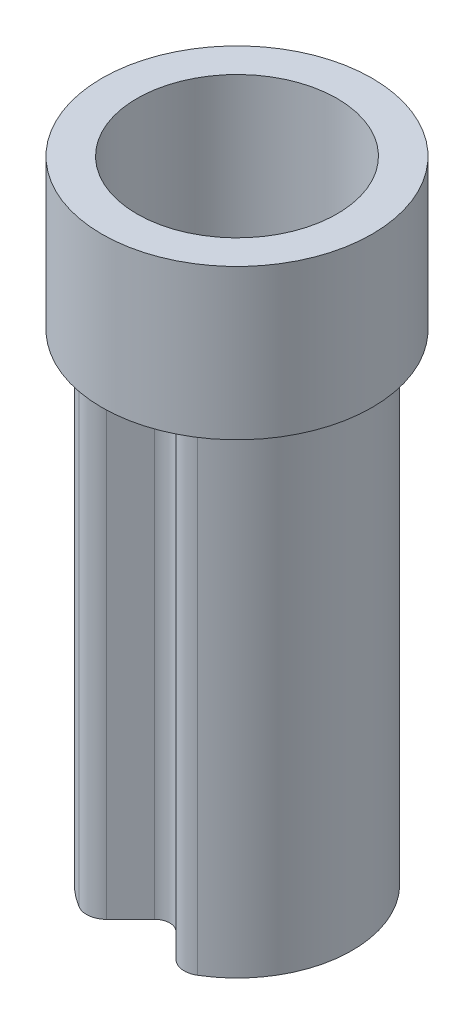
ISO-10303-21;
HEADER;
FILE_DESCRIPTION(('STEP AP214'),'2;1');
FILE_NAME('part.step','',(''),(''),'','','');
FILE_SCHEMA(('AUTOMOTIVE_DESIGN { 1 0 10303 214 1 1 1 1 }'));
ENDSEC;
DATA;
#1=APPLICATION_CONTEXT('core data for automotive mechanical design processes');
#2=APPLICATION_PROTOCOL_DEFINITION('international standard','automotive_design',2000,#1);
#3=PRODUCT_CONTEXT('',#1,'mechanical');
#4=PRODUCT('Part','Part','',(#3));
#5=PRODUCT_RELATED_PRODUCT_CATEGORY('part','',(#4));
#6=PRODUCT_DEFINITION_FORMATION('','',#4);
#7=PRODUCT_DEFINITION_CONTEXT('part definition',#1,'design');
#8=PRODUCT_DEFINITION('design','',#6,#7);
#9=PRODUCT_DEFINITION_SHAPE('','',#8);
#10=(LENGTH_UNIT() NAMED_UNIT(*) SI_UNIT(.MILLI.,.METRE.));
#11=(NAMED_UNIT(*) PLANE_ANGLE_UNIT() SI_UNIT($,.RADIAN.));
#12=(NAMED_UNIT(*) SI_UNIT($,.STERADIAN.) SOLID_ANGLE_UNIT());
#13=UNCERTAINTY_MEASURE_WITH_UNIT(LENGTH_MEASURE(1.E-05),#10,'distance_accuracy_value','');
#14=(GEOMETRIC_REPRESENTATION_CONTEXT(3) GLOBAL_UNCERTAINTY_ASSIGNED_CONTEXT((#13)) GLOBAL_UNIT_ASSIGNED_CONTEXT((#10,
#11,#12)) REPRESENTATION_CONTEXT('',''));
#15=CARTESIAN_POINT('',(0.,0.,0.));
#16=DIRECTION('',(0.,0.,1.));
#17=DIRECTION('',(1.,0.,0.));
#18=AXIS2_PLACEMENT_3D('',#15,#16,#17);
#19=CARTESIAN_POINT('',(0.,4.8,0.822132034355964));
#20=DIRECTION('',(0.,1.,0.));
#21=DIRECTION('',(0.,0.,1.));
#22=AXIS2_PLACEMENT_3D('',#19,#20,#21);
#23=PLANE('',#22);
#24=DIRECTION('',(0.707106781186548,0.,0.707106781186548));
#25=VECTOR('',#24,1.);
#26=CARTESIAN_POINT('',(0.106066017177983,4.8,0.716066017177983));
#27=LINE('',#26,#25);
#28=CARTESIAN_POINT('',(0.106066017177983,4.8,0.716066017177983));
#29=VERTEX_POINT('',#28);
#30=CARTESIAN_POINT('',(0.332945922473057,4.8,0.942945922473057));
#31=VERTEX_POINT('',#30);
#32=EDGE_CURVE('E154',#29,#31,#27,.T.);
#33=ORIENTED_EDGE('',*,*,#32,.T.);
#34=CARTESIAN_POINT('',(0.,4.8,0.));
#35=DIRECTION('',(0.,1.,0.));
#36=DIRECTION('',(0.,0.,1.));
#37=AXIS2_PLACEMENT_3D('',#34,#35,#36);
#38=CIRCLE('',#37,1.);
#39=CARTESIAN_POINT('',(0.513633561053512,4.8,0.858009653185492));
#40=VERTEX_POINT('',#39);
#41=EDGE_CURVE('E137',#31,#40,#38,.T.);
#42=ORIENTED_EDGE('',*,*,#41,.T.);
#43=CARTESIAN_POINT('',(0.487951883000837,4.8,0.815109170526217));
#44=DIRECTION('',(0.,1.,0.));
#45=DIRECTION('',(0.,0.,1.));
#46=AXIS2_PLACEMENT_3D('',#43,#44,#45);
#47=CIRCLE('',#46,0.05);
#48=CARTESIAN_POINT('',(0.452596543941509,4.8,0.850464509585545));
#49=VERTEX_POINT('',#48);
#50=EDGE_CURVE('E194',#40,#49,#47,.F.);
#51=ORIENTED_EDGE('',*,*,#50,.T.);
#52=DIRECTION('',(0.707106781186548,0.,0.707106781186547));
#53=VECTOR('',#52,1.);
#54=CARTESIAN_POINT('',(0.212132034355966,4.8,0.610000000000001));
#55=LINE('',#54,#53);
#56=CARTESIAN_POINT('',(0.212132034355966,4.8,0.610000000000002));
#57=VERTEX_POINT('',#56);
#58=EDGE_CURVE('E227',#57,#49,#55,.T.);
#59=ORIENTED_EDGE('',*,*,#58,.F.);
#60=CARTESIAN_POINT('',(0.,4.8,0.822132034355964));
#61=DIRECTION('',(0.,-1.,0.));
#62=DIRECTION('',(0.,0.,1.));
#63=AXIS2_PLACEMENT_3D('',#60,#61,#62);
#64=CIRCLE('',#63,0.3);
#65=CARTESIAN_POINT('',(-0.212132034355965,4.8,0.610000000000001));
#66=VERTEX_POINT('',#65);
#67=EDGE_CURVE('E223',#66,#57,#64,.T.);
#68=ORIENTED_EDGE('',*,*,#67,.F.);
#69=DIRECTION('',(0.707106781186547,0.,-0.707106781186548));
#70=VECTOR('',#69,1.);
#71=CARTESIAN_POINT('',(-0.479612456619358,4.8,0.877480422263394));
#72=LINE('',#71,#70);
#73=CARTESIAN_POINT('',(-0.452596543941509,4.8,0.850464509585545));
#74=VERTEX_POINT('',#73);
#75=EDGE_CURVE('E221',#74,#66,#72,.T.);
#76=ORIENTED_EDGE('',*,*,#75,.F.);
#77=CARTESIAN_POINT('',(-0.487951883000836,4.8,0.815109170526217));
#78=DIRECTION('',(0.,1.,0.));
#79=DIRECTION('',(0.,0.,1.));
#80=AXIS2_PLACEMENT_3D('',#77,#78,#79);
#81=CIRCLE('',#80,0.05);
#82=CARTESIAN_POINT('',(-0.513633561053512,4.8,0.858009653185492));
#83=VERTEX_POINT('',#82);
#84=EDGE_CURVE('E197',#74,#83,#81,.F.);
#85=ORIENTED_EDGE('',*,*,#84,.T.);
#86=CARTESIAN_POINT('',(-0.332945922473057,4.8,0.942945922473057));
#87=VERTEX_POINT('',#86);
#88=EDGE_CURVE('E12',#83,#87,#38,.T.);
#89=ORIENTED_EDGE('',*,*,#88,.T.);
#90=DIRECTION('',(0.707106781186547,0.,-0.707106781186548));
#91=VECTOR('',#90,1.);
#92=CARTESIAN_POINT('',(-0.448807004477936,4.8,1.05880700447794));
#93=LINE('',#92,#91);
#94=CARTESIAN_POINT('',(-0.106066017177983,4.8,0.716066017177983));
#95=VERTEX_POINT('',#94);
#96=EDGE_CURVE('E164',#87,#95,#93,.T.);
#97=ORIENTED_EDGE('',*,*,#96,.T.);
#98=CARTESIAN_POINT('',(0.,4.8,0.822132034355964));
#99=DIRECTION('',(0.,-1.,0.));
#100=DIRECTION('',(0.,0.,1.));
#101=AXIS2_PLACEMENT_3D('',#98,#99,#100);
#102=CIRCLE('',#101,0.15);
#103=EDGE_CURVE('E159',#95,#29,#102,.T.);
#104=ORIENTED_EDGE('',*,*,#103,.T.);
#105=EDGE_LOOP('',(#33,#42,#51,#59,#68,#76,#85,#89,#97,#104));
#106=FACE_BOUND('',#105,.T.);
#107=ADVANCED_FACE('F36',(#106),#23,.T.);
#108=CARTESIAN_POINT('',(0.,0.,0.822132034355964));
#109=DIRECTION('',(0.,1.,0.));
#110=DIRECTION('',(0.,0.,1.));
#111=AXIS2_PLACEMENT_3D('',#108,#109,#110);
#112=PLANE('',#111);
#113=CARTESIAN_POINT('',(0.,0.,0.));
#114=DIRECTION('',(0.,1.,0.));
#115=DIRECTION('',(0.,0.,1.));
#116=AXIS2_PLACEMENT_3D('',#113,#114,#115);
#117=CIRCLE('',#116,1.15);
#118=CARTESIAN_POINT('',(0.590678595211539,0.,0.986711101163316));
#119=VERTEX_POINT('',#118);
#120=CARTESIAN_POINT('',(-0.590678595211538,0.,0.986711101163316));
#121=VERTEX_POINT('',#120);
#122=EDGE_CURVE('E177',#119,#121,#117,.T.);
#123=ORIENTED_EDGE('',*,*,#122,.F.);
#124=CARTESIAN_POINT('',(0.487951883000836,0.,0.815109170526217));
#125=DIRECTION('',(0.,1.,0.));
#126=DIRECTION('',(0.,0.,1.));
#127=AXIS2_PLACEMENT_3D('',#124,#125,#126);
#128=CIRCLE('',#127,0.2);
#129=CARTESIAN_POINT('',(0.346530526763527,0.,0.956530526763527));
#130=VERTEX_POINT('',#129);
#131=EDGE_CURVE('E61',#119,#130,#128,.F.);
#132=ORIENTED_EDGE('',*,*,#131,.T.);
#133=DIRECTION('',(0.707106781186548,0.,0.707106781186548));
#134=VECTOR('',#133,1.);
#135=CARTESIAN_POINT('',(0.106066017177983,0.,0.716066017177983));
#136=LINE('',#135,#134);
#137=CARTESIAN_POINT('',(0.106066017177983,0.,0.716066017177983));
#138=VERTEX_POINT('',#137);
#139=EDGE_CURVE('E174',#138,#130,#136,.T.);
#140=ORIENTED_EDGE('',*,*,#139,.F.);
#141=CARTESIAN_POINT('',(0.,0.,0.822132034355964));
#142=DIRECTION('',(0.,-1.,0.));
#143=DIRECTION('',(0.,0.,1.));
#144=AXIS2_PLACEMENT_3D('',#141,#142,#143);
#145=CIRCLE('',#144,0.15);
#146=CARTESIAN_POINT('',(-0.106066017177983,0.,0.716066017177983));
#147=VERTEX_POINT('',#146);
#148=EDGE_CURVE('E171',#147,#138,#145,.T.);
#149=ORIENTED_EDGE('',*,*,#148,.F.);
#150=DIRECTION('',(0.707106781186547,0.,-0.707106781186548));
#151=VECTOR('',#150,1.);
#152=CARTESIAN_POINT('',(-0.448807004477936,0.,1.05880700447794));
#153=LINE('',#152,#151);
#154=CARTESIAN_POINT('',(-0.346530526763527,0.,0.956530526763527));
#155=VERTEX_POINT('',#154);
#156=EDGE_CURVE('E180',#155,#147,#153,.T.);
#157=ORIENTED_EDGE('',*,*,#156,.F.);
#158=CARTESIAN_POINT('',(-0.487951883000836,0.,0.815109170526218));
#159=DIRECTION('',(0.,1.,0.));
#160=DIRECTION('',(0.,0.,1.));
#161=AXIS2_PLACEMENT_3D('',#158,#159,#160);
#162=CIRCLE('',#161,0.2);
#163=EDGE_CURVE('E204',#155,#121,#162,.F.);
#164=ORIENTED_EDGE('',*,*,#163,.T.);
#165=EDGE_LOOP('',(#123,#132,#140,#149,#157,#164));
#166=FACE_BOUND('',#165,.T.);
#167=DIRECTION('',(0.707106781186548,0.,0.707106781186547));
#168=VECTOR('',#167,1.);
#169=CARTESIAN_POINT('',(0.212132034355966,0.,0.610000000000001));
#170=LINE('',#169,#168);
#171=CARTESIAN_POINT('',(0.212132034355966,0.,0.610000000000002));
#172=VERTEX_POINT('',#171);
#173=CARTESIAN_POINT('',(0.452596543941509,0.,0.850464509585545));
#174=VERTEX_POINT('',#173);
#175=EDGE_CURVE('E224',#172,#174,#170,.T.);
#176=ORIENTED_EDGE('',*,*,#175,.T.);
#177=CARTESIAN_POINT('',(0.487951883000837,0.,0.815109170526217));
#178=DIRECTION('',(0.,1.,0.));
#179=DIRECTION('',(0.,0.,1.));
#180=AXIS2_PLACEMENT_3D('',#177,#178,#179);
#181=CIRCLE('',#180,0.05);
#182=CARTESIAN_POINT('',(0.513633561053512,0.,0.858009653185492));
#183=VERTEX_POINT('',#182);
#184=EDGE_CURVE('E192',#174,#183,#181,.T.);
#185=ORIENTED_EDGE('',*,*,#184,.T.);
#186=CARTESIAN_POINT('',(0.,0.,0.));
#187=DIRECTION('',(0.,1.,0.));
#188=DIRECTION('',(0.,0.,1.));
#189=AXIS2_PLACEMENT_3D('',#186,#187,#188);
#190=CIRCLE('',#189,1.);
#191=CARTESIAN_POINT('',(-0.513633561053512,0.,0.858009653185492));
#192=VERTEX_POINT('',#191);
#193=EDGE_CURVE('E231',#183,#192,#190,.T.);
#194=ORIENTED_EDGE('',*,*,#193,.T.);
#195=CARTESIAN_POINT('',(-0.487951883000836,0.,0.815109170526217));
#196=DIRECTION('',(0.,1.,0.));
#197=DIRECTION('',(0.,0.,1.));
#198=AXIS2_PLACEMENT_3D('',#195,#196,#197);
#199=CIRCLE('',#198,0.05);
#200=CARTESIAN_POINT('',(-0.452596543941509,0.,0.850464509585545));
#201=VERTEX_POINT('',#200);
#202=EDGE_CURVE('E195',#192,#201,#199,.T.);
#203=ORIENTED_EDGE('',*,*,#202,.T.);
#204=DIRECTION('',(0.707106781186547,0.,-0.707106781186548));
#205=VECTOR('',#204,1.);
#206=CARTESIAN_POINT('',(-0.479612456619358,0.,0.877480422263394));
#207=LINE('',#206,#205);
#208=CARTESIAN_POINT('',(-0.212132034355965,0.,0.610000000000001));
#209=VERTEX_POINT('',#208);
#210=EDGE_CURVE('E234',#201,#209,#207,.T.);
#211=ORIENTED_EDGE('',*,*,#210,.T.);
#212=CARTESIAN_POINT('',(0.,0.,0.822132034355964));
#213=DIRECTION('',(0.,-1.,0.));
#214=DIRECTION('',(0.,0.,1.));
#215=AXIS2_PLACEMENT_3D('',#212,#213,#214);
#216=CIRCLE('',#215,0.3);
#217=EDGE_CURVE('E237',#209,#172,#216,.T.);
#218=ORIENTED_EDGE('',*,*,#217,.T.);
#219=EDGE_LOOP('',(#176,#185,#194,#203,#211,#218));
#220=FACE_BOUND('',#219,.T.);
#221=ADVANCED_FACE('F255',(#166,#220),#112,.F.);
#222=CARTESIAN_POINT('',(0.,4.8,0.822132034355964));
#223=DIRECTION('',(0.,-1.,0.));
#224=DIRECTION('',(0.,0.,-1.));
#225=AXIS2_PLACEMENT_3D('',#222,#223,#224);
#226=CYLINDRICAL_SURFACE('',#225,0.15);
#227=ORIENTED_EDGE('',*,*,#148,.T.);
#228=DIRECTION('',(0.,-1.,0.));
#229=VECTOR('',#228,1.);
#230=CARTESIAN_POINT('',(0.106066017177983,4.8,0.716066017177983));
#231=LINE('',#230,#229);
#232=EDGE_CURVE('E184',#29,#138,#231,.T.);
#233=ORIENTED_EDGE('',*,*,#232,.F.);
#234=ORIENTED_EDGE('',*,*,#103,.F.);
#235=DIRECTION('',(0.,-1.,0.));
#236=VECTOR('',#235,1.);
#237=CARTESIAN_POINT('',(-0.106066017177983,4.8,0.716066017177983));
#238=LINE('',#237,#236);
#239=EDGE_CURVE('E170',#95,#147,#238,.T.);
#240=ORIENTED_EDGE('',*,*,#239,.T.);
#241=EDGE_LOOP('',(#227,#233,#234,#240));
#242=FACE_BOUND('',#241,.T.);
#243=ADVANCED_FACE('F291',(#242),#226,.F.);
#244=CARTESIAN_POINT('',(0.106066017177983,4.8,0.716066017177983));
#245=DIRECTION('',(0.707106781186548,0.,-0.707106781186547));
#246=DIRECTION('',(-0.707106781186547,0.,-0.707106781186548));
#247=AXIS2_PLACEMENT_3D('',#244,#245,#246);
#248=PLANE('',#247);
#249=ORIENTED_EDGE('',*,*,#139,.T.);
#250=DIRECTION('',(0.,-1.,0.));
#251=VECTOR('',#250,1.);
#252=CARTESIAN_POINT('',(0.346530526763527,4.8,0.956530526763527));
#253=LINE('',#252,#251);
#254=CARTESIAN_POINT('',(0.346530526763527,4.8,0.956530526763527));
#255=VERTEX_POINT('',#254);
#256=EDGE_CURVE('E157',#130,#255,#253,.F.);
#257=ORIENTED_EDGE('',*,*,#256,.T.);
#258=EDGE_CURVE('E133',#31,#255,#27,.T.);
#259=ORIENTED_EDGE('',*,*,#258,.F.);
#260=ORIENTED_EDGE('',*,*,#32,.F.);
#261=ORIENTED_EDGE('',*,*,#232,.T.);
#262=EDGE_LOOP('',(#249,#257,#259,#260,#261));
#263=FACE_BOUND('',#262,.T.);
#264=ADVANCED_FACE('F152',(#263),#248,.F.);
#265=CARTESIAN_POINT('',(0.,4.8,0.));
#266=DIRECTION('',(0.,-1.,0.));
#267=DIRECTION('',(0.,0.,-1.));
#268=AXIS2_PLACEMENT_3D('',#265,#266,#267);
#269=CYLINDRICAL_SURFACE('',#268,1.15);
#270=CARTESIAN_POINT('',(0.,4.8,0.));
#271=DIRECTION('',(0.,1.,0.));
#272=DIRECTION('',(0.,0.,1.));
#273=AXIS2_PLACEMENT_3D('',#270,#271,#272);
#274=CIRCLE('',#273,1.15);
#275=CARTESIAN_POINT('',(0.590678595211539,4.8,0.986711101163316));
#276=VERTEX_POINT('',#275);
#277=CARTESIAN_POINT('',(-0.590678595211538,4.8,0.986711101163316));
#278=VERTEX_POINT('',#277);
#279=EDGE_CURVE('E163',#276,#278,#274,.T.);
#280=ORIENTED_EDGE('',*,*,#279,.F.);
#281=DIRECTION('',(0.,-1.,0.));
#282=VECTOR('',#281,1.);
#283=CARTESIAN_POINT('',(0.590678595211539,4.8,0.986711101163316));
#284=LINE('',#283,#282);
#285=EDGE_CURVE('E201',#276,#119,#284,.T.);
#286=ORIENTED_EDGE('',*,*,#285,.T.);
#287=ORIENTED_EDGE('',*,*,#122,.T.);
#288=DIRECTION('',(0.,-1.,0.));
#289=VECTOR('',#288,1.);
#290=CARTESIAN_POINT('',(-0.590678595211539,4.8,0.986711101163316));
#291=LINE('',#290,#289);
#292=EDGE_CURVE('E198',#121,#278,#291,.F.);
#293=ORIENTED_EDGE('',*,*,#292,.T.);
#294=EDGE_LOOP('',(#280,#286,#287,#293));
#295=FACE_BOUND('',#294,.T.);
#296=ADVANCED_FACE('F299',(#295),#269,.T.);
#297=CARTESIAN_POINT('',(-0.448807004477936,4.8,1.05880700447794));
#298=DIRECTION('',(-0.707106781186548,0.,-0.707106781186547));
#299=DIRECTION('',(-0.707106781186547,0.,0.707106781186548));
#300=AXIS2_PLACEMENT_3D('',#297,#298,#299);
#301=PLANE('',#300);
#302=CARTESIAN_POINT('',(-0.346530526763527,4.8,0.956530526763527));
#303=VERTEX_POINT('',#302);
#304=EDGE_CURVE('E136',#303,#87,#93,.T.);
#305=ORIENTED_EDGE('',*,*,#304,.F.);
#306=DIRECTION('',(0.,-1.,0.));
#307=VECTOR('',#306,1.);
#308=CARTESIAN_POINT('',(-0.346530526763527,4.8,0.956530526763527));
#309=LINE('',#308,#307);
#310=EDGE_CURVE('E45',#303,#155,#309,.T.);
#311=ORIENTED_EDGE('',*,*,#310,.T.);
#312=ORIENTED_EDGE('',*,*,#156,.T.);
#313=ORIENTED_EDGE('',*,*,#239,.F.);
#314=ORIENTED_EDGE('',*,*,#96,.F.);
#315=EDGE_LOOP('',(#305,#311,#312,#313,#314));
#316=FACE_BOUND('',#315,.T.);
#317=ADVANCED_FACE('F296',(#316),#301,.F.);
#318=CARTESIAN_POINT('',(0.,4.8,0.));
#319=DIRECTION('',(0.,-1.,0.));
#320=DIRECTION('',(0.,0.,-1.));
#321=AXIS2_PLACEMENT_3D('',#318,#319,#320);
#322=CYLINDRICAL_SURFACE('',#321,1.);
#323=ORIENTED_EDGE('',*,*,#193,.F.);
#324=DIRECTION('',(0.,-1.,0.));
#325=VECTOR('',#324,1.);
#326=CARTESIAN_POINT('',(0.513633561053512,4.8,0.858009653185492));
#327=LINE('',#326,#325);
#328=EDGE_CURVE('E145',#183,#40,#327,.F.);
#329=ORIENTED_EDGE('',*,*,#328,.T.);
#330=ORIENTED_EDGE('',*,*,#41,.F.);
#331=EDGE_CURVE('E53',#87,#31,#38,.T.);
#332=ORIENTED_EDGE('',*,*,#331,.F.);
#333=ORIENTED_EDGE('',*,*,#88,.F.);
#334=DIRECTION('',(0.,-1.,0.));
#335=VECTOR('',#334,1.);
#336=CARTESIAN_POINT('',(-0.513633561053512,4.8,0.858009653185492));
#337=LINE('',#336,#335);
#338=EDGE_CURVE('E189',#83,#192,#337,.T.);
#339=ORIENTED_EDGE('',*,*,#338,.T.);
#340=EDGE_LOOP('',(#323,#329,#330,#332,#333,#339));
#341=FACE_BOUND('',#340,.T.);
#342=CARTESIAN_POINT('',(0.,6.3,0.));
#343=DIRECTION('',(0.,1.,0.));
#344=DIRECTION('',(0.,0.,1.));
#345=AXIS2_PLACEMENT_3D('',#342,#343,#344);
#346=CIRCLE('',#345,1.);
#347=CARTESIAN_POINT('',(0.,6.3,1.));
#348=VERTEX_POINT('',#347);
#349=EDGE_CURVE('E138',#348,#348,#346,.T.);
#350=ORIENTED_EDGE('',*,*,#349,.T.);
#351=EDGE_LOOP('',(#350));
#352=FACE_BOUND('',#351,.T.);
#353=ADVANCED_FACE('F142',(#341,#352),#322,.F.);
#354=CARTESIAN_POINT('',(-0.479612456619358,4.8,0.877480422263394));
#355=DIRECTION('',(-0.707106781186548,0.,-0.707106781186547));
#356=DIRECTION('',(-0.707106781186547,0.,0.707106781186548));
#357=AXIS2_PLACEMENT_3D('',#354,#355,#356);
#358=PLANE('',#357);
#359=ORIENTED_EDGE('',*,*,#210,.F.);
#360=DIRECTION('',(0.,1.,0.));
#361=VECTOR('',#360,1.);
#362=CARTESIAN_POINT('',(-0.452596543941509,4.8,0.850464509585545));
#363=LINE('',#362,#361);
#364=EDGE_CURVE('E190',#201,#74,#363,.T.);
#365=ORIENTED_EDGE('',*,*,#364,.T.);
#366=ORIENTED_EDGE('',*,*,#75,.T.);
#367=DIRECTION('',(0.,-1.,0.));
#368=VECTOR('',#367,1.);
#369=CARTESIAN_POINT('',(-0.212132034355965,4.8,0.610000000000001));
#370=LINE('',#369,#368);
#371=EDGE_CURVE('E175',#66,#209,#370,.T.);
#372=ORIENTED_EDGE('',*,*,#371,.T.);
#373=EDGE_LOOP('',(#359,#365,#366,#372));
#374=FACE_BOUND('',#373,.T.);
#375=ADVANCED_FACE('F247',(#374),#358,.T.);
#376=CARTESIAN_POINT('',(0.,4.8,0.822132034355964));
#377=DIRECTION('',(0.,-1.,0.));
#378=DIRECTION('',(0.,0.,-1.));
#379=AXIS2_PLACEMENT_3D('',#376,#377,#378);
#380=CYLINDRICAL_SURFACE('',#379,0.3);
#381=ORIENTED_EDGE('',*,*,#217,.F.);
#382=ORIENTED_EDGE('',*,*,#371,.F.);
#383=ORIENTED_EDGE('',*,*,#67,.T.);
#384=DIRECTION('',(0.,-1.,0.));
#385=VECTOR('',#384,1.);
#386=CARTESIAN_POINT('',(0.212132034355966,4.8,0.610000000000002));
#387=LINE('',#386,#385);
#388=EDGE_CURVE('E230',#57,#172,#387,.T.);
#389=ORIENTED_EDGE('',*,*,#388,.T.);
#390=EDGE_LOOP('',(#381,#382,#383,#389));
#391=FACE_BOUND('',#390,.T.);
#392=ADVANCED_FACE('F252',(#391),#380,.T.);
#393=CARTESIAN_POINT('',(0.212132034355966,4.8,0.610000000000001));
#394=DIRECTION('',(0.707106781186547,0.,-0.707106781186548));
#395=DIRECTION('',(-0.707106781186548,0.,-0.707106781186547));
#396=AXIS2_PLACEMENT_3D('',#393,#394,#395);
#397=PLANE('',#396);
#398=ORIENTED_EDGE('',*,*,#58,.T.);
#399=DIRECTION('',(0.,1.,0.));
#400=VECTOR('',#399,1.);
#401=CARTESIAN_POINT('',(0.452596543941509,0.,0.850464509585545));
#402=LINE('',#401,#400);
#403=EDGE_CURVE('E186',#49,#174,#402,.F.);
#404=ORIENTED_EDGE('',*,*,#403,.T.);
#405=ORIENTED_EDGE('',*,*,#175,.F.);
#406=ORIENTED_EDGE('',*,*,#388,.F.);
#407=EDGE_LOOP('',(#398,#404,#405,#406));
#408=FACE_BOUND('',#407,.T.);
#409=ADVANCED_FACE('F274',(#408),#397,.T.);
#410=CARTESIAN_POINT('',(0.487951883000837,4.8,0.815109170526217));
#411=DIRECTION('',(0.,-1.,0.));
#412=DIRECTION('',(0.,0.,-1.));
#413=AXIS2_PLACEMENT_3D('',#410,#411,#412);
#414=CYLINDRICAL_SURFACE('',#413,0.05);
#415=ORIENTED_EDGE('',*,*,#50,.F.);
#416=ORIENTED_EDGE('',*,*,#328,.F.);
#417=ORIENTED_EDGE('',*,*,#184,.F.);
#418=ORIENTED_EDGE('',*,*,#403,.F.);
#419=EDGE_LOOP('',(#415,#416,#417,#418));
#420=FACE_BOUND('',#419,.T.);
#421=ADVANCED_FACE('F275',(#420),#414,.F.);
#422=CARTESIAN_POINT('',(-0.487951883000836,4.8,0.815109170526217));
#423=DIRECTION('',(0.,-1.,0.));
#424=DIRECTION('',(0.,0.,-1.));
#425=AXIS2_PLACEMENT_3D('',#422,#423,#424);
#426=CYLINDRICAL_SURFACE('',#425,0.05);
#427=ORIENTED_EDGE('',*,*,#84,.F.);
#428=ORIENTED_EDGE('',*,*,#364,.F.);
#429=ORIENTED_EDGE('',*,*,#202,.F.);
#430=ORIENTED_EDGE('',*,*,#338,.F.);
#431=EDGE_LOOP('',(#427,#428,#429,#430));
#432=FACE_BOUND('',#431,.T.);
#433=ADVANCED_FACE('F260',(#432),#426,.F.);
#434=CARTESIAN_POINT('',(0.487951883000836,4.8,0.815109170526217));
#435=DIRECTION('',(0.,-1.,0.));
#436=DIRECTION('',(0.,0.,-1.));
#437=AXIS2_PLACEMENT_3D('',#434,#435,#436);
#438=CYLINDRICAL_SURFACE('',#437,0.2);
#439=CARTESIAN_POINT('',(0.487951883000836,4.8,0.815109170526217));
#440=DIRECTION('',(0.,1.,0.));
#441=DIRECTION('',(0.,0.,1.));
#442=AXIS2_PLACEMENT_3D('',#439,#440,#441);
#443=CIRCLE('',#442,0.2);
#444=EDGE_CURVE('E210',#255,#276,#443,.T.);
#445=ORIENTED_EDGE('',*,*,#444,.F.);
#446=ORIENTED_EDGE('',*,*,#256,.F.);
#447=ORIENTED_EDGE('',*,*,#131,.F.);
#448=ORIENTED_EDGE('',*,*,#285,.F.);
#449=EDGE_LOOP('',(#445,#446,#447,#448));
#450=FACE_BOUND('',#449,.T.);
#451=ADVANCED_FACE('F282',(#450),#438,.T.);
#452=CARTESIAN_POINT('',(-0.487951883000836,4.8,0.815109170526218));
#453=DIRECTION('',(0.,-1.,0.));
#454=DIRECTION('',(0.,0.,-1.));
#455=AXIS2_PLACEMENT_3D('',#452,#453,#454);
#456=CYLINDRICAL_SURFACE('',#455,0.2);
#457=CARTESIAN_POINT('',(-0.487951883000836,4.8,0.815109170526218));
#458=DIRECTION('',(0.,1.,0.));
#459=DIRECTION('',(0.,0.,1.));
#460=AXIS2_PLACEMENT_3D('',#457,#458,#459);
#461=CIRCLE('',#460,0.2);
#462=EDGE_CURVE('E208',#278,#303,#461,.T.);
#463=ORIENTED_EDGE('',*,*,#462,.F.);
#464=ORIENTED_EDGE('',*,*,#292,.F.);
#465=ORIENTED_EDGE('',*,*,#163,.F.);
#466=ORIENTED_EDGE('',*,*,#310,.F.);
#467=EDGE_LOOP('',(#463,#464,#465,#466));
#468=FACE_BOUND('',#467,.T.);
#469=ADVANCED_FACE('F38',(#468),#456,.T.);
#470=CARTESIAN_POINT('',(0.,4.8,0.));
#471=DIRECTION('',(0.,1.,0.));
#472=DIRECTION('',(0.,0.,1.));
#473=AXIS2_PLACEMENT_3D('',#470,#471,#472);
#474=PLANE('',#473);
#475=CARTESIAN_POINT('',(0.,4.8,0.));
#476=DIRECTION('',(0.,1.,0.));
#477=DIRECTION('',(0.,0.,1.));
#478=AXIS2_PLACEMENT_3D('',#475,#476,#477);
#479=CIRCLE('',#478,1.35);
#480=CARTESIAN_POINT('',(0.,4.8,1.35));
#481=VERTEX_POINT('',#480);
#482=EDGE_CURVE('E149',#481,#481,#479,.T.);
#483=ORIENTED_EDGE('',*,*,#482,.F.);
#484=EDGE_LOOP('',(#483));
#485=FACE_BOUND('',#484,.T.);
#486=ORIENTED_EDGE('',*,*,#331,.T.);
#487=ORIENTED_EDGE('',*,*,#258,.T.);
#488=ORIENTED_EDGE('',*,*,#444,.T.);
#489=ORIENTED_EDGE('',*,*,#279,.T.);
#490=ORIENTED_EDGE('',*,*,#462,.T.);
#491=ORIENTED_EDGE('',*,*,#304,.T.);
#492=EDGE_LOOP('',(#486,#487,#488,#489,#490,#491));
#493=FACE_BOUND('',#492,.T.);
#494=ADVANCED_FACE('F131',(#485,#493),#474,.F.);
#495=CARTESIAN_POINT('',(0.,16.4183766184074,0.));
#496=DIRECTION('',(0.,-1.,0.));
#497=DIRECTION('',(0.,0.,-1.));
#498=AXIS2_PLACEMENT_3D('',#495,#496,#497);
#499=CYLINDRICAL_SURFACE('',#498,1.35);
#500=ORIENTED_EDGE('',*,*,#482,.T.);
#501=EDGE_LOOP('',(#500));
#502=FACE_BOUND('',#501,.T.);
#503=CARTESIAN_POINT('',(0.,6.3,0.));
#504=DIRECTION('',(0.,1.,0.));
#505=DIRECTION('',(0.,0.,1.));
#506=AXIS2_PLACEMENT_3D('',#503,#504,#505);
#507=CIRCLE('',#506,1.35);
#508=CARTESIAN_POINT('',(0.,6.3,1.35));
#509=VERTEX_POINT('',#508);
#510=EDGE_CURVE('E235',#509,#509,#507,.T.);
#511=ORIENTED_EDGE('',*,*,#510,.F.);
#512=EDGE_LOOP('',(#511));
#513=FACE_BOUND('',#512,.T.);
#514=ADVANCED_FACE('F325',(#502,#513),#499,.T.);
#515=CARTESIAN_POINT('',(0.,6.3,0.822132034355964));
#516=DIRECTION('',(0.,1.,0.));
#517=DIRECTION('',(0.,0.,1.));
#518=AXIS2_PLACEMENT_3D('',#515,#516,#517);
#519=PLANE('',#518);
#520=ORIENTED_EDGE('',*,*,#349,.F.);
#521=EDGE_LOOP('',(#520));
#522=FACE_BOUND('',#521,.T.);
#523=ORIENTED_EDGE('',*,*,#510,.T.);
#524=EDGE_LOOP('',(#523));
#525=FACE_BOUND('',#524,.T.);
#526=ADVANCED_FACE('F407',(#522,#525),#519,.T.);
#527=CLOSED_SHELL('',(#107,#221,#243,#264,#296,#317,#353,#375,#392,#409,#421,#433,#451,#469,
#494,#514,#526));
#528=MANIFOLD_SOLID_BREP('B2',#527);
#529=ADVANCED_BREP_SHAPE_REPRESENTATION('',(#18,#528),#14);
#530=SHAPE_DEFINITION_REPRESENTATION(#9,#529);
ENDSEC;
END-ISO-10303-21;
